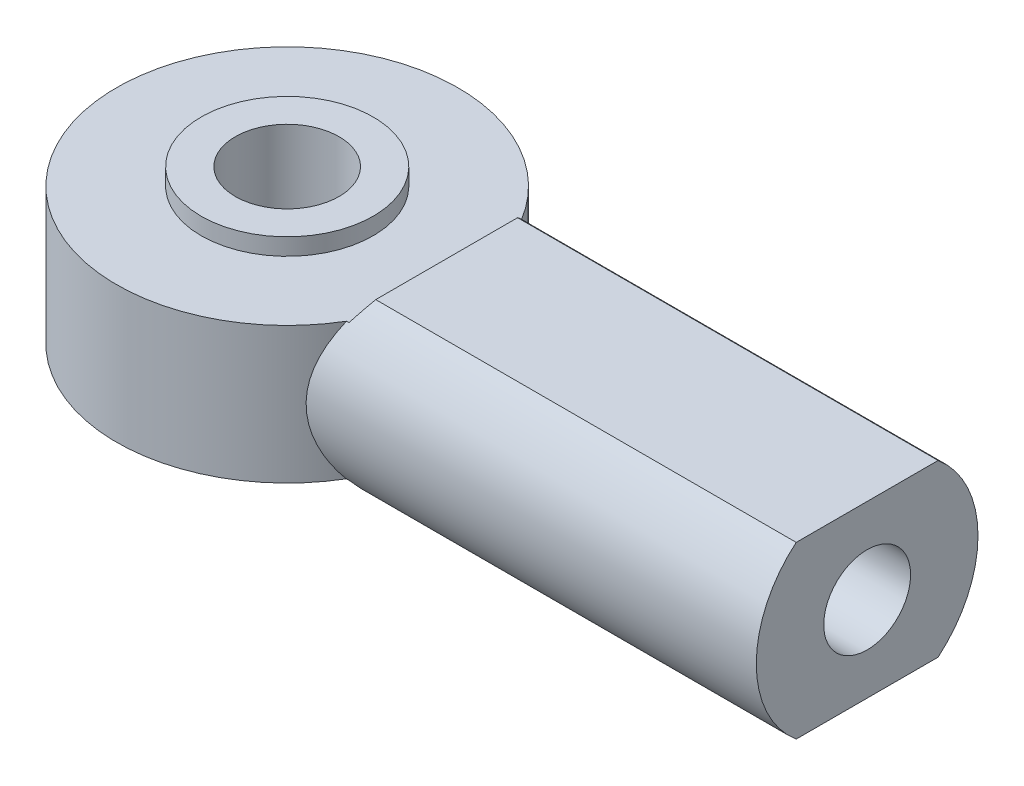
ISO-10303-21;
HEADER;
FILE_DESCRIPTION(('STEP AP214'),'2;1');
FILE_NAME('part.step','',(''),(''),'','','');
FILE_SCHEMA(('AUTOMOTIVE_DESIGN { 1 0 10303 214 1 1 1 1 }'));
ENDSEC;
DATA;
#1=APPLICATION_CONTEXT('core data for automotive mechanical design processes');
#2=APPLICATION_PROTOCOL_DEFINITION('international standard','automotive_design',2000,#1);
#3=PRODUCT_CONTEXT('',#1,'mechanical');
#4=PRODUCT('Part','Part','',(#3));
#5=PRODUCT_RELATED_PRODUCT_CATEGORY('part','',(#4));
#6=PRODUCT_DEFINITION_FORMATION('','',#4);
#7=PRODUCT_DEFINITION_CONTEXT('part definition',#1,'design');
#8=PRODUCT_DEFINITION('design','',#6,#7);
#9=PRODUCT_DEFINITION_SHAPE('','',#8);
#10=(LENGTH_UNIT() NAMED_UNIT(*) SI_UNIT(.MILLI.,.METRE.));
#11=(NAMED_UNIT(*) PLANE_ANGLE_UNIT() SI_UNIT($,.RADIAN.));
#12=(NAMED_UNIT(*) SI_UNIT($,.STERADIAN.) SOLID_ANGLE_UNIT());
#13=UNCERTAINTY_MEASURE_WITH_UNIT(LENGTH_MEASURE(1.E-05),#10,'distance_accuracy_value','');
#14=(GEOMETRIC_REPRESENTATION_CONTEXT(3) GLOBAL_UNCERTAINTY_ASSIGNED_CONTEXT((#13)) GLOBAL_UNIT_ASSIGNED_CONTEXT((#10,
#11,#12)) REPRESENTATION_CONTEXT('',''));
#15=CARTESIAN_POINT('',(0.,0.,0.));
#16=DIRECTION('',(0.,0.,1.));
#17=DIRECTION('',(1.,0.,0.));
#18=AXIS2_PLACEMENT_3D('',#15,#16,#17);
#19=CARTESIAN_POINT('',(0.,3.175,0.));
#20=DIRECTION('',(0.,1.,0.));
#21=DIRECTION('',(0.,0.,1.));
#22=AXIS2_PLACEMENT_3D('',#19,#20,#21);
#23=PLANE('',#22);
#24=CARTESIAN_POINT('',(0.,3.175,0.));
#25=DIRECTION('',(0.,1.,0.));
#26=DIRECTION('',(0.,0.,1.));
#27=AXIS2_PLACEMENT_3D('',#24,#25,#26);
#28=CIRCLE('',#27,7.9375);
#29=CARTESIAN_POINT('',(6.81895393810517,3.175,-4.06272980150046));
#30=VERTEX_POINT('',#29);
#31=CARTESIAN_POINT('',(6.81895393810517,3.175,4.06272980150046));
#32=VERTEX_POINT('',#31);
#33=EDGE_CURVE('E269',#30,#32,#28,.T.);
#34=ORIENTED_EDGE('',*,*,#33,.T.);
#35=DIRECTION('',(-1.,0.,0.));
#36=VECTOR('',#35,1.);
#37=CARTESIAN_POINT('',(26.9748,3.175,4.06272980150046));
#38=LINE('',#37,#36);
#39=CARTESIAN_POINT('',(6.9342,3.175,4.06272980150046));
#40=VERTEX_POINT('',#39);
#41=EDGE_CURVE('E155',#40,#32,#38,.T.);
#42=ORIENTED_EDGE('',*,*,#41,.F.);
#43=DIRECTION('',(0.,0.,1.));
#44=VECTOR('',#43,1.);
#45=CARTESIAN_POINT('',(6.9342,3.175,-7.9375));
#46=LINE('',#45,#44);
#47=CARTESIAN_POINT('',(6.9342,3.175,-4.06272980150046));
#48=VERTEX_POINT('',#47);
#49=EDGE_CURVE('E146',#48,#40,#46,.T.);
#50=ORIENTED_EDGE('',*,*,#49,.F.);
#51=DIRECTION('',(-1.,0.,0.));
#52=VECTOR('',#51,1.);
#53=CARTESIAN_POINT('',(26.9748,3.175,-4.06272980150046));
#54=LINE('',#53,#52);
#55=EDGE_CURVE('E150',#30,#48,#54,.F.);
#56=ORIENTED_EDGE('',*,*,#55,.F.);
#57=EDGE_LOOP('',(#34,#42,#50,#56));
#58=FACE_BOUND('',#57,.T.);
#59=CARTESIAN_POINT('',(0.,3.175,0.));
#60=DIRECTION('',(0.,1.,0.));
#61=DIRECTION('',(0.,0.,1.));
#62=AXIS2_PLACEMENT_3D('',#59,#60,#61);
#63=CIRCLE('',#62,4.0005);
#64=CARTESIAN_POINT('',(0.,3.175,4.0005));
#65=VERTEX_POINT('',#64);
#66=EDGE_CURVE('E130',#65,#65,#63,.F.);
#67=ORIENTED_EDGE('',*,*,#66,.T.);
#68=EDGE_LOOP('',(#67));
#69=FACE_BOUND('',#68,.T.);
#70=ADVANCED_FACE('F38',(#58,#69),#23,.T.);
#71=CARTESIAN_POINT('',(0.,-3.175,0.));
#72=DIRECTION('',(0.,1.,0.));
#73=DIRECTION('',(0.,0.,1.));
#74=AXIS2_PLACEMENT_3D('',#71,#72,#73);
#75=PLANE('',#74);
#76=DIRECTION('',(-1.,0.,0.));
#77=VECTOR('',#76,1.);
#78=CARTESIAN_POINT('',(26.9748,-3.175,4.06272980150046));
#79=LINE('',#78,#77);
#80=CARTESIAN_POINT('',(6.81895393810517,-3.175,4.06272980150046));
#81=VERTEX_POINT('',#80);
#82=CARTESIAN_POINT('',(6.9342,-3.175,4.06272980150046));
#83=VERTEX_POINT('',#82);
#84=EDGE_CURVE('E138',#81,#83,#79,.F.);
#85=ORIENTED_EDGE('',*,*,#84,.F.);
#86=CARTESIAN_POINT('',(0.,-3.175,0.));
#87=DIRECTION('',(0.,1.,0.));
#88=DIRECTION('',(0.,0.,1.));
#89=AXIS2_PLACEMENT_3D('',#86,#87,#88);
#90=CIRCLE('',#89,7.9375);
#91=CARTESIAN_POINT('',(6.81895393810517,-3.175,-4.06272980150046));
#92=VERTEX_POINT('',#91);
#93=EDGE_CURVE('E268',#92,#81,#90,.T.);
#94=ORIENTED_EDGE('',*,*,#93,.F.);
#95=DIRECTION('',(-1.,0.,0.));
#96=VECTOR('',#95,1.);
#97=CARTESIAN_POINT('',(26.9748,-3.175,-4.06272980150046));
#98=LINE('',#97,#96);
#99=CARTESIAN_POINT('',(6.9342,-3.175,-4.06272980150046));
#100=VERTEX_POINT('',#99);
#101=EDGE_CURVE('E267',#100,#92,#98,.T.);
#102=ORIENTED_EDGE('',*,*,#101,.F.);
#103=DIRECTION('',(0.,0.,1.));
#104=VECTOR('',#103,1.);
#105=CARTESIAN_POINT('',(6.9342,-3.175,-7.9375));
#106=LINE('',#105,#104);
#107=EDGE_CURVE('E135',#100,#83,#106,.T.);
#108=ORIENTED_EDGE('',*,*,#107,.T.);
#109=EDGE_LOOP('',(#85,#94,#102,#108));
#110=FACE_BOUND('',#109,.T.);
#111=CARTESIAN_POINT('',(0.,-3.175,0.));
#112=DIRECTION('',(0.,1.,0.));
#113=DIRECTION('',(0.,0.,1.));
#114=AXIS2_PLACEMENT_3D('',#111,#112,#113);
#115=CIRCLE('',#114,4.0005);
#116=CARTESIAN_POINT('',(0.,-3.175,4.0005));
#117=VERTEX_POINT('',#116);
#118=EDGE_CURVE('E11',#117,#117,#115,.F.);
#119=ORIENTED_EDGE('',*,*,#118,.F.);
#120=EDGE_LOOP('',(#119));
#121=FACE_BOUND('',#120,.T.);
#122=ADVANCED_FACE('F212',(#110,#121),#75,.F.);
#123=CARTESIAN_POINT('',(0.,3.175,0.));
#124=DIRECTION('',(0.,-1.,0.));
#125=DIRECTION('',(0.,0.,-1.));
#126=AXIS2_PLACEMENT_3D('',#123,#124,#125);
#127=CYLINDRICAL_SURFACE('',#126,7.9375);
#128=CARTESIAN_POINT('',(6.81895393810517,3.175,4.06272980150046));
#129=CARTESIAN_POINT('',(6.77029650636042,3.07045821401911,4.14440453102014));
#130=CARTESIAN_POINT('',(6.72199909649033,2.96272662445,4.22212031276705));
#131=CARTESIAN_POINT('',(6.62720828503116,2.74089561141832,4.36940384145221));
#132=CARTESIAN_POINT('',(6.58071687213445,2.62678948771619,4.43896276746964));
#133=CARTESIAN_POINT('',(6.44507830389198,2.27355509422377,4.6357653550012));
#134=CARTESIAN_POINT('',(6.36051509621903,2.02504910296549,4.74992527519349));
#135=CARTESIAN_POINT('',(6.22667686807699,1.54833360673344,4.92367447828306));
#136=CARTESIAN_POINT('',(6.17391821681974,1.32325532294526,4.98907770303664));
#137=CARTESIAN_POINT('',(6.11237385995678,0.977986403158434,5.06397040350975));
#138=CARTESIAN_POINT('',(6.09480366737661,0.861789135410965,5.08505262110774));
#139=CARTESIAN_POINT('',(6.06611290970553,0.627459254440665,5.11924711032753));
#140=CARTESIAN_POINT('',(6.05498978814676,0.50932742746517,5.13236254113181));
#141=CARTESIAN_POINT('',(6.03961078680158,0.271270020117113,5.15045137017017));
#142=CARTESIAN_POINT('',(6.03539699999814,0.151337904268396,5.1553748642211));
#143=CARTESIAN_POINT('',(6.03415002000365,-0.0886161537000329,5.15683439189908));
#144=CARTESIAN_POINT('',(6.03711690104155,-0.208638096735496,5.15337033882127));
#145=CARTESIAN_POINT('',(6.05010896659136,-0.447866235954696,5.13811137302704));
#146=CARTESIAN_POINT('',(6.06014002660416,-0.567071669628434,5.12630952547732));
#147=CARTESIAN_POINT('',(6.08683238550706,-0.803660817078277,5.09458506486365));
#148=CARTESIAN_POINT('',(6.10349631134843,-0.921043789906478,5.07465923421429));
#149=CARTESIAN_POINT('',(6.15982557357438,-1.25350809468949,5.00637854089279));
#150=CARTESIAN_POINT('',(6.20692713874937,-1.4654214549521,4.94833289141523));
#151=CARTESIAN_POINT('',(6.31661177689351,-1.87658335018917,4.80751652794485));
#152=CARTESIAN_POINT('',(6.37920871566105,-2.07582034008733,4.72472365543398));
#153=CARTESIAN_POINT('',(6.50383843241356,-2.430133900164,4.55121535732323));
#154=CARTESIAN_POINT('',(6.56447475203391,-2.58728718212277,4.46368135993084));
#155=CARTESIAN_POINT('',(6.68955321755607,-2.88986791709109,4.27395945777576));
#156=CARTESIAN_POINT('',(6.75397850415046,-3.03534137606225,4.17183394859004));
#157=CARTESIAN_POINT('',(6.81895393810517,-3.175,4.06272980150046));
#158=B_SPLINE_CURVE_WITH_KNOTS('',3,(#128,#129,#130,#131,#132,#133,#134,#135,#136,#137,#138,
#139,#140,#141,#142,#143,#144,#145,#146,#147,#148,#149,#150,#151,#152,#153,#154,#155,#156,#157),
.UNSPECIFIED.,.F.,.F.,(4,2,2,2,2,2,2,2,2,2,2,2,2,2,4),(0.,0.423707437856326,0.847868933017516,
1.70241415540586,2.41998850783576,2.77777753501112,3.13542459027162,3.49524251183192,
3.85506415296551,4.21518542312966,4.57544946172184,5.24682199159484,5.91879747449113,
6.48733218221838,7.05350472423717),.UNSPECIFIED.);
#159=EDGE_CURVE('E189',#32,#81,#158,.T.);
#160=ORIENTED_EDGE('',*,*,#159,.F.);
#161=ORIENTED_EDGE('',*,*,#33,.F.);
#162=CARTESIAN_POINT('',(6.81895393810517,-3.175,-4.06272980150046));
#163=CARTESIAN_POINT('',(6.77029650636042,-3.07045821401911,-4.14440453102014));
#164=CARTESIAN_POINT('',(6.72199909649033,-2.96272662445,-4.22212031276705));
#165=CARTESIAN_POINT('',(6.62720828503116,-2.74089561141832,-4.36940384145221));
#166=CARTESIAN_POINT('',(6.58071687213445,-2.62678948771619,-4.43896276746964));
#167=CARTESIAN_POINT('',(6.44507830389198,-2.27355509422377,-4.6357653550012));
#168=CARTESIAN_POINT('',(6.36051509621904,-2.02504910296549,-4.74992527519349));
#169=CARTESIAN_POINT('',(6.22667686807699,-1.54833360673344,-4.92367447828306));
#170=CARTESIAN_POINT('',(6.17391821681974,-1.32325532294526,-4.98907770303664));
#171=CARTESIAN_POINT('',(6.11237385995679,-0.977986403158433,-5.06397040350975));
#172=CARTESIAN_POINT('',(6.09480366737661,-0.861789135410964,-5.08505262110773));
#173=CARTESIAN_POINT('',(6.06611290970553,-0.627459254440663,-5.11924711032753));
#174=CARTESIAN_POINT('',(6.05498978814676,-0.509327427465168,-5.13236254113181));
#175=CARTESIAN_POINT('',(6.03961078680158,-0.271270020117111,-5.15045137017016));
#176=CARTESIAN_POINT('',(6.03539699999814,-0.151337904268394,-5.1553748642211));
#177=CARTESIAN_POINT('',(6.03415002000365,0.0886161537000353,-5.15683439189908));
#178=CARTESIAN_POINT('',(6.03711690104156,0.208638096735498,-5.15337033882127));
#179=CARTESIAN_POINT('',(6.05010896659136,0.447866235954699,-5.13811137302704));
#180=CARTESIAN_POINT('',(6.06014002660416,0.567071669628438,-5.12630952547732));
#181=CARTESIAN_POINT('',(6.08683238550706,0.803660817078281,-5.09458506486365));
#182=CARTESIAN_POINT('',(6.10349631134843,0.921043789906481,-5.07465923421429));
#183=CARTESIAN_POINT('',(6.15982557357438,1.25350809468949,-5.00637854089279));
#184=CARTESIAN_POINT('',(6.20692713874937,1.4654214549521,-4.94833289141523));
#185=CARTESIAN_POINT('',(6.31661177689351,1.87658335018917,-4.80751652794485));
#186=CARTESIAN_POINT('',(6.37920871566105,2.07582034008733,-4.72472365543398));
#187=CARTESIAN_POINT('',(6.50383843241356,2.43013390016401,-4.55121535732323));
#188=CARTESIAN_POINT('',(6.56447475203391,2.58728718212277,-4.46368135993084));
#189=CARTESIAN_POINT('',(6.68955321755607,2.88986791709109,-4.27395945777576));
#190=CARTESIAN_POINT('',(6.75397850415046,3.03534137606225,-4.17183394859004));
#191=CARTESIAN_POINT('',(6.81895393810517,3.175,-4.06272980150046));
#192=B_SPLINE_CURVE_WITH_KNOTS('',3,(#162,#163,#164,#165,#166,#167,#168,#169,#170,#171,#172,
#173,#174,#175,#176,#177,#178,#179,#180,#181,#182,#183,#184,#185,#186,#187,#188,#189,#190,#191),
.UNSPECIFIED.,.F.,.F.,(4,2,2,2,2,2,2,2,2,2,2,2,2,2,4),(0.,0.423707437856325,0.847868933017515,
1.70241415540586,2.41998850783576,2.77777753501112,3.13542459027162,3.49524251183192,
3.85506415296551,4.21518542312966,4.57544946172185,5.24682199159484,5.91879747449114,
6.48733218221838,7.05350472423717),.UNSPECIFIED.);
#193=EDGE_CURVE('E182',#92,#30,#192,.T.);
#194=ORIENTED_EDGE('',*,*,#193,.F.);
#195=ORIENTED_EDGE('',*,*,#93,.T.);
#196=EDGE_LOOP('',(#160,#161,#194,#195));
#197=FACE_BOUND('',#196,.T.);
#198=ADVANCED_FACE('F40',(#197),#127,.T.);
#199=CARTESIAN_POINT('',(26.9748,0.,0.));
#200=DIRECTION('',(-1.,0.,0.));
#201=DIRECTION('',(0.,0.,1.));
#202=AXIS2_PLACEMENT_3D('',#199,#200,#201);
#203=CYLINDRICAL_SURFACE('',#202,5.1562);
#204=ORIENTED_EDGE('',*,*,#84,.T.);
#205=CARTESIAN_POINT('',(4.98823225806452,0.,0.));
#206=DIRECTION('',(0.852601252410943,0.522562057929286,0.));
#207=DIRECTION('',(-0.522562057929286,0.852601252410943,0.));
#208=AXIS2_PLACEMENT_3D('',#205,#206,#207);
#209=ELLIPSE('',#208,6.04761016409436,5.1562);
#210=CARTESIAN_POINT('',(7.4168,-3.9624,3.29936125333374));
#211=VERTEX_POINT('',#210);
#212=EDGE_CURVE('E143',#83,#211,#209,.T.);
#213=ORIENTED_EDGE('',*,*,#212,.T.);
#214=DIRECTION('',(-1.,0.,0.));
#215=VECTOR('',#214,1.);
#216=CARTESIAN_POINT('',(26.9748,-3.9624,3.29936125333374));
#217=LINE('',#216,#215);
#218=CARTESIAN_POINT('',(26.9748,-3.9624,3.29936125333374));
#219=VERTEX_POINT('',#218);
#220=EDGE_CURVE('E179',#219,#211,#217,.T.);
#221=ORIENTED_EDGE('',*,*,#220,.F.);
#222=CARTESIAN_POINT('',(26.9748,0.,0.));
#223=DIRECTION('',(1.,0.,0.));
#224=DIRECTION('',(0.,0.,-1.));
#225=AXIS2_PLACEMENT_3D('',#222,#223,#224);
#226=CIRCLE('',#225,5.1562);
#227=CARTESIAN_POINT('',(26.9748,3.9624,3.29936125333374));
#228=VERTEX_POINT('',#227);
#229=EDGE_CURVE('E164',#228,#219,#226,.T.);
#230=ORIENTED_EDGE('',*,*,#229,.F.);
#231=DIRECTION('',(-1.,0.,0.));
#232=VECTOR('',#231,1.);
#233=CARTESIAN_POINT('',(26.9748,3.9624,3.29936125333374));
#234=LINE('',#233,#232);
#235=CARTESIAN_POINT('',(7.4168,3.9624,3.29936125333374));
#236=VERTEX_POINT('',#235);
#237=EDGE_CURVE('E170',#228,#236,#234,.T.);
#238=ORIENTED_EDGE('',*,*,#237,.T.);
#239=CARTESIAN_POINT('',(4.98823225806452,0.,0.));
#240=DIRECTION('',(0.852601252410943,-0.522562057929286,0.));
#241=DIRECTION('',(-0.522562057929286,-0.852601252410943,0.));
#242=AXIS2_PLACEMENT_3D('',#239,#240,#241);
#243=ELLIPSE('',#242,6.04761016409436,5.1562);
#244=EDGE_CURVE('E161',#236,#40,#243,.T.);
#245=ORIENTED_EDGE('',*,*,#244,.T.);
#246=ORIENTED_EDGE('',*,*,#41,.T.);
#247=ORIENTED_EDGE('',*,*,#159,.T.);
#248=EDGE_LOOP('',(#204,#213,#221,#230,#238,#245,#246,#247));
#249=FACE_BOUND('',#248,.T.);
#250=ADVANCED_FACE('F205',(#249),#203,.T.);
#251=CARTESIAN_POINT('',(26.9748,-3.9624,3.29936125333374));
#252=DIRECTION('',(0.,1.,0.));
#253=DIRECTION('',(0.,0.,1.));
#254=AXIS2_PLACEMENT_3D('',#251,#252,#253);
#255=PLANE('',#254);
#256=ORIENTED_EDGE('',*,*,#220,.T.);
#257=DIRECTION('',(0.,0.,1.));
#258=VECTOR('',#257,1.);
#259=CARTESIAN_POINT('',(7.4168,-3.9624,-7.9375));
#260=LINE('',#259,#258);
#261=CARTESIAN_POINT('',(7.4168,-3.9624,-3.29936125333373));
#262=VERTEX_POINT('',#261);
#263=EDGE_CURVE('E136',#262,#211,#260,.T.);
#264=ORIENTED_EDGE('',*,*,#263,.F.);
#265=DIRECTION('',(-1.,0.,0.));
#266=VECTOR('',#265,1.);
#267=CARTESIAN_POINT('',(26.9748,-3.9624,-3.29936125333374));
#268=LINE('',#267,#266);
#269=CARTESIAN_POINT('',(26.9748,-3.9624,-3.29936125333374));
#270=VERTEX_POINT('',#269);
#271=EDGE_CURVE('E176',#270,#262,#268,.T.);
#272=ORIENTED_EDGE('',*,*,#271,.F.);
#273=DIRECTION('',(0.,0.,-1.));
#274=VECTOR('',#273,1.);
#275=CARTESIAN_POINT('',(26.9748,-3.9624,3.29936125333374));
#276=LINE('',#275,#274);
#277=EDGE_CURVE('E166',#219,#270,#276,.T.);
#278=ORIENTED_EDGE('',*,*,#277,.F.);
#279=EDGE_LOOP('',(#256,#264,#272,#278));
#280=FACE_BOUND('',#279,.T.);
#281=ADVANCED_FACE('F201',(#280),#255,.F.);
#282=CARTESIAN_POINT('',(26.9748,0.,0.));
#283=DIRECTION('',(-1.,0.,0.));
#284=DIRECTION('',(0.,0.,1.));
#285=AXIS2_PLACEMENT_3D('',#282,#283,#284);
#286=CYLINDRICAL_SURFACE('',#285,5.1562);
#287=ORIENTED_EDGE('',*,*,#271,.T.);
#288=CARTESIAN_POINT('',(4.98823225806452,0.,0.));
#289=DIRECTION('',(0.852601252410943,0.522562057929286,0.));
#290=DIRECTION('',(-0.522562057929286,0.852601252410943,0.));
#291=AXIS2_PLACEMENT_3D('',#288,#289,#290);
#292=ELLIPSE('',#291,6.04761016409436,5.1562);
#293=EDGE_CURVE('E47',#262,#100,#292,.T.);
#294=ORIENTED_EDGE('',*,*,#293,.T.);
#295=ORIENTED_EDGE('',*,*,#101,.T.);
#296=ORIENTED_EDGE('',*,*,#193,.T.);
#297=ORIENTED_EDGE('',*,*,#55,.T.);
#298=CARTESIAN_POINT('',(4.98823225806452,0.,0.));
#299=DIRECTION('',(0.852601252410943,-0.522562057929286,0.));
#300=DIRECTION('',(-0.522562057929286,-0.852601252410943,0.));
#301=AXIS2_PLACEMENT_3D('',#298,#299,#300);
#302=ELLIPSE('',#301,6.04761016409436,5.1562);
#303=CARTESIAN_POINT('',(7.4168,3.9624,-3.29936125333374));
#304=VERTEX_POINT('',#303);
#305=EDGE_CURVE('E158',#48,#304,#302,.T.);
#306=ORIENTED_EDGE('',*,*,#305,.T.);
#307=DIRECTION('',(-1.,0.,0.));
#308=VECTOR('',#307,1.);
#309=CARTESIAN_POINT('',(26.9748,3.9624,-3.29936125333374));
#310=LINE('',#309,#308);
#311=CARTESIAN_POINT('',(26.9748,3.9624,-3.29936125333374));
#312=VERTEX_POINT('',#311);
#313=EDGE_CURVE('E173',#312,#304,#310,.T.);
#314=ORIENTED_EDGE('',*,*,#313,.F.);
#315=CARTESIAN_POINT('',(26.9748,0.,0.));
#316=DIRECTION('',(1.,0.,0.));
#317=DIRECTION('',(0.,0.,-1.));
#318=AXIS2_PLACEMENT_3D('',#315,#316,#317);
#319=CIRCLE('',#318,5.1562);
#320=EDGE_CURVE('E59',#270,#312,#319,.T.);
#321=ORIENTED_EDGE('',*,*,#320,.F.);
#322=EDGE_LOOP('',(#287,#294,#295,#296,#297,#306,#314,#321));
#323=FACE_BOUND('',#322,.T.);
#324=ADVANCED_FACE('F195',(#323),#286,.T.);
#325=CARTESIAN_POINT('',(26.9748,3.9624,3.29936125333374));
#326=DIRECTION('',(0.,-1.,0.));
#327=DIRECTION('',(0.,0.,-1.));
#328=AXIS2_PLACEMENT_3D('',#325,#326,#327);
#329=PLANE('',#328);
#330=ORIENTED_EDGE('',*,*,#313,.T.);
#331=DIRECTION('',(0.,0.,1.));
#332=VECTOR('',#331,1.);
#333=CARTESIAN_POINT('',(7.4168,3.9624,-7.9375));
#334=LINE('',#333,#332);
#335=EDGE_CURVE('E147',#304,#236,#334,.T.);
#336=ORIENTED_EDGE('',*,*,#335,.T.);
#337=ORIENTED_EDGE('',*,*,#237,.F.);
#338=DIRECTION('',(0.,0.,1.));
#339=VECTOR('',#338,1.);
#340=CARTESIAN_POINT('',(26.9748,3.9624,3.29936125333374));
#341=LINE('',#340,#339);
#342=EDGE_CURVE('E54',#312,#228,#341,.T.);
#343=ORIENTED_EDGE('',*,*,#342,.F.);
#344=EDGE_LOOP('',(#330,#336,#337,#343));
#345=FACE_BOUND('',#344,.T.);
#346=ADVANCED_FACE('F200',(#345),#329,.F.);
#347=CARTESIAN_POINT('',(26.9748,0.,0.));
#348=DIRECTION('',(1.,0.,0.));
#349=DIRECTION('',(0.,0.,-1.));
#350=AXIS2_PLACEMENT_3D('',#347,#348,#349);
#351=PLANE('',#350);
#352=CARTESIAN_POINT('',(26.9748,0.,0.));
#353=DIRECTION('',(1.,0.,0.));
#354=DIRECTION('',(0.,0.,-1.));
#355=AXIS2_PLACEMENT_3D('',#352,#353,#354);
#356=CIRCLE('',#355,2.01929999999999);
#357=CARTESIAN_POINT('',(26.9748,0.,-2.01929999999999));
#358=VERTEX_POINT('',#357);
#359=EDGE_CURVE('E116',#358,#358,#356,.T.);
#360=ORIENTED_EDGE('',*,*,#359,.F.);
#361=EDGE_LOOP('',(#360));
#362=FACE_BOUND('',#361,.T.);
#363=ORIENTED_EDGE('',*,*,#229,.T.);
#364=ORIENTED_EDGE('',*,*,#277,.T.);
#365=ORIENTED_EDGE('',*,*,#320,.T.);
#366=ORIENTED_EDGE('',*,*,#342,.T.);
#367=EDGE_LOOP('',(#363,#364,#365,#366));
#368=FACE_BOUND('',#367,.T.);
#369=ADVANCED_FACE('F248',(#362,#368),#351,.T.);
#370=CARTESIAN_POINT('',(6.9342,3.175,-7.9375));
#371=DIRECTION('',(0.852601252410943,-0.522562057929286,0.));
#372=DIRECTION('',(0.522562057929286,0.852601252410943,0.));
#373=AXIS2_PLACEMENT_3D('',#370,#371,#372);
#374=PLANE('',#373);
#375=ORIENTED_EDGE('',*,*,#335,.F.);
#376=ORIENTED_EDGE('',*,*,#305,.F.);
#377=ORIENTED_EDGE('',*,*,#49,.T.);
#378=ORIENTED_EDGE('',*,*,#244,.F.);
#379=EDGE_LOOP('',(#375,#376,#377,#378));
#380=FACE_BOUND('',#379,.T.);
#381=ADVANCED_FACE('F245',(#380),#374,.F.);
#382=CARTESIAN_POINT('',(6.9342,-3.175,-7.9375));
#383=DIRECTION('',(0.852601252410943,0.522562057929286,0.));
#384=DIRECTION('',(-0.522562057929286,0.852601252410943,0.));
#385=AXIS2_PLACEMENT_3D('',#382,#383,#384);
#386=PLANE('',#385);
#387=ORIENTED_EDGE('',*,*,#107,.F.);
#388=ORIENTED_EDGE('',*,*,#293,.F.);
#389=ORIENTED_EDGE('',*,*,#263,.T.);
#390=ORIENTED_EDGE('',*,*,#212,.F.);
#391=EDGE_LOOP('',(#387,#388,#389,#390));
#392=FACE_BOUND('',#391,.T.);
#393=ADVANCED_FACE('F238',(#392),#386,.F.);
#394=CARTESIAN_POINT('',(0.,-3.9624,0.));
#395=DIRECTION('',(0.,1.,0.));
#396=DIRECTION('',(0.,0.,1.));
#397=AXIS2_PLACEMENT_3D('',#394,#395,#396);
#398=PLANE('',#397);
#399=CARTESIAN_POINT('',(0.,-3.9624,0.));
#400=DIRECTION('',(0.,1.,0.));
#401=DIRECTION('',(0.,0.,1.));
#402=AXIS2_PLACEMENT_3D('',#399,#400,#401);
#403=CIRCLE('',#402,2.413);
#404=CARTESIAN_POINT('',(0.,-3.9624,2.413));
#405=VERTEX_POINT('',#404);
#406=EDGE_CURVE('E119',#405,#405,#403,.T.);
#407=ORIENTED_EDGE('',*,*,#406,.T.);
#408=EDGE_LOOP('',(#407));
#409=FACE_BOUND('',#408,.T.);
#410=CARTESIAN_POINT('',(0.,-3.9624,0.));
#411=DIRECTION('',(0.,1.,0.));
#412=DIRECTION('',(0.,0.,1.));
#413=AXIS2_PLACEMENT_3D('',#410,#411,#412);
#414=CIRCLE('',#413,4.0005);
#415=CARTESIAN_POINT('',(0.,-3.9624,4.0005));
#416=VERTEX_POINT('',#415);
#417=EDGE_CURVE('E125',#416,#416,#414,.T.);
#418=ORIENTED_EDGE('',*,*,#417,.F.);
#419=EDGE_LOOP('',(#418));
#420=FACE_BOUND('',#419,.T.);
#421=ADVANCED_FACE('F229',(#409,#420),#398,.F.);
#422=CARTESIAN_POINT('',(0.,3.9624,0.));
#423=DIRECTION('',(0.,-1.,0.));
#424=DIRECTION('',(0.,0.,-1.));
#425=AXIS2_PLACEMENT_3D('',#422,#423,#424);
#426=CYLINDRICAL_SURFACE('',#425,4.0005);
#427=ORIENTED_EDGE('',*,*,#417,.T.);
#428=EDGE_LOOP('',(#427));
#429=FACE_BOUND('',#428,.T.);
#430=ORIENTED_EDGE('',*,*,#118,.T.);
#431=EDGE_LOOP('',(#430));
#432=FACE_BOUND('',#431,.T.);
#433=ADVANCED_FACE('F226',(#429,#432),#426,.T.);
#434=ORIENTED_EDGE('',*,*,#66,.F.);
#435=EDGE_LOOP('',(#434));
#436=FACE_BOUND('',#435,.T.);
#437=CARTESIAN_POINT('',(0.,3.9624,0.));
#438=DIRECTION('',(0.,1.,0.));
#439=DIRECTION('',(0.,0.,1.));
#440=AXIS2_PLACEMENT_3D('',#437,#438,#439);
#441=CIRCLE('',#440,4.0005);
#442=CARTESIAN_POINT('',(0.,3.9624,4.0005));
#443=VERTEX_POINT('',#442);
#444=EDGE_CURVE('E127',#443,#443,#441,.T.);
#445=ORIENTED_EDGE('',*,*,#444,.F.);
#446=EDGE_LOOP('',(#445));
#447=FACE_BOUND('',#446,.T.);
#448=ADVANCED_FACE('F228',(#436,#447),#426,.T.);
#449=CARTESIAN_POINT('',(0.,3.9624,0.));
#450=DIRECTION('',(0.,1.,0.));
#451=DIRECTION('',(0.,0.,1.));
#452=AXIS2_PLACEMENT_3D('',#449,#450,#451);
#453=PLANE('',#452);
#454=CARTESIAN_POINT('',(0.,3.9624,0.));
#455=DIRECTION('',(0.,1.,0.));
#456=DIRECTION('',(0.,0.,1.));
#457=AXIS2_PLACEMENT_3D('',#454,#455,#456);
#458=CIRCLE('',#457,2.413);
#459=CARTESIAN_POINT('',(0.,3.9624,2.413));
#460=VERTEX_POINT('',#459);
#461=EDGE_CURVE('E115',#460,#460,#458,.T.);
#462=ORIENTED_EDGE('',*,*,#461,.F.);
#463=EDGE_LOOP('',(#462));
#464=FACE_BOUND('',#463,.T.);
#465=ORIENTED_EDGE('',*,*,#444,.T.);
#466=EDGE_LOOP('',(#465));
#467=FACE_BOUND('',#466,.T.);
#468=ADVANCED_FACE('F236',(#464,#467),#453,.T.);
#469=CARTESIAN_POINT('',(0.,-3.9624,0.));
#470=DIRECTION('',(0.,1.,0.));
#471=DIRECTION('',(0.,0.,1.));
#472=AXIS2_PLACEMENT_3D('',#469,#470,#471);
#473=CYLINDRICAL_SURFACE('',#472,2.413);
#474=ORIENTED_EDGE('',*,*,#406,.F.);
#475=EDGE_LOOP('',(#474));
#476=FACE_BOUND('',#475,.T.);
#477=ORIENTED_EDGE('',*,*,#461,.T.);
#478=EDGE_LOOP('',(#477));
#479=FACE_BOUND('',#478,.T.);
#480=ADVANCED_FACE('F109',(#476,#479),#473,.F.);
#481=CARTESIAN_POINT('',(12.7508,0.,0.));
#482=DIRECTION('',(1.,0.,0.));
#483=DIRECTION('',(0.,0.,-1.));
#484=AXIS2_PLACEMENT_3D('',#481,#482,#483);
#485=CONICAL_SURFACE('',#484,2.01929999999999,1.02974425867665);
#486=CARTESIAN_POINT('',(11.5374821519976,0.,0.));
#487=VERTEX_POINT('',#486);
#488=VERTEX_LOOP('',#487);
#489=FACE_BOUND('',#488,.T.);
#490=CARTESIAN_POINT('',(12.7508,0.,0.));
#491=DIRECTION('',(1.,0.,0.));
#492=DIRECTION('',(0.,0.,-1.));
#493=AXIS2_PLACEMENT_3D('',#490,#491,#492);
#494=CIRCLE('',#493,2.01929999999999);
#495=CARTESIAN_POINT('',(12.7508,0.,-2.01929999999999));
#496=VERTEX_POINT('',#495);
#497=EDGE_CURVE('E113',#496,#496,#494,.T.);
#498=ORIENTED_EDGE('',*,*,#497,.T.);
#499=EDGE_LOOP('',(#498));
#500=FACE_BOUND('',#499,.T.);
#501=ADVANCED_FACE('F105',(#489,#500),#485,.F.);
#502=CARTESIAN_POINT('',(26.9748,0.,0.));
#503=DIRECTION('',(1.,0.,0.));
#504=DIRECTION('',(0.,0.,-1.));
#505=AXIS2_PLACEMENT_3D('',#502,#503,#504);
#506=CYLINDRICAL_SURFACE('',#505,2.01929999999999);
#507=ORIENTED_EDGE('',*,*,#497,.F.);
#508=EDGE_LOOP('',(#507));
#509=FACE_BOUND('',#508,.T.);
#510=ORIENTED_EDGE('',*,*,#359,.T.);
#511=EDGE_LOOP('',(#510));
#512=FACE_BOUND('',#511,.T.);
#513=ADVANCED_FACE('F108',(#509,#512),#506,.F.);
#514=CLOSED_SHELL('',(#70,#122,#198,#250,#281,#324,#346,#369,#381,#393,#421,#433,#448,#468,#480,
#501,#513));
#515=MANIFOLD_SOLID_BREP('B2',#514);
#516=ADVANCED_BREP_SHAPE_REPRESENTATION('',(#18,#515),#14);
#517=SHAPE_DEFINITION_REPRESENTATION(#9,#516);
ENDSEC;
END-ISO-10303-21;
